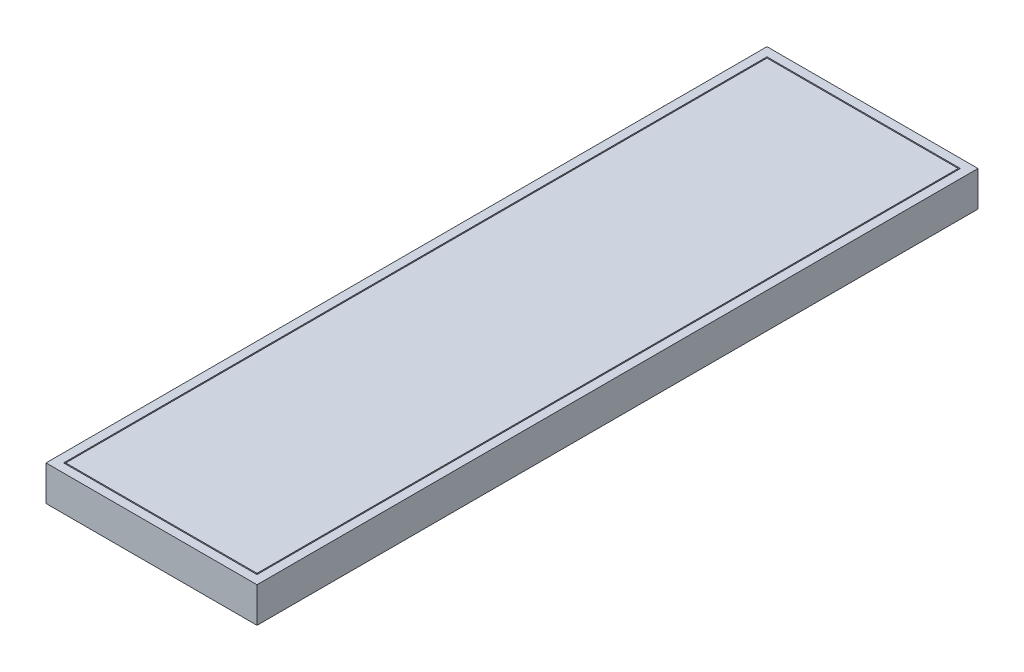
ISO-10303-21;
HEADER;
FILE_DESCRIPTION(('STEP AP214'),'2;1');
FILE_NAME('part.step','',(''),(''),'','','');
FILE_SCHEMA(('AUTOMOTIVE_DESIGN { 1 0 10303 214 1 1 1 1 }'));
ENDSEC;
DATA;
#1=APPLICATION_CONTEXT('core data for automotive mechanical design processes');
#2=APPLICATION_PROTOCOL_DEFINITION('international standard','automotive_design',2000,#1);
#3=PRODUCT_CONTEXT('',#1,'mechanical');
#4=PRODUCT('Part','Part','',(#3));
#5=PRODUCT_RELATED_PRODUCT_CATEGORY('part','',(#4));
#6=PRODUCT_DEFINITION_FORMATION('','',#4);
#7=PRODUCT_DEFINITION_CONTEXT('part definition',#1,'design');
#8=PRODUCT_DEFINITION('design','',#6,#7);
#9=PRODUCT_DEFINITION_SHAPE('','',#8);
#10=(LENGTH_UNIT() NAMED_UNIT(*) SI_UNIT(.MILLI.,.METRE.));
#11=(NAMED_UNIT(*) PLANE_ANGLE_UNIT() SI_UNIT($,.RADIAN.));
#12=(NAMED_UNIT(*) SI_UNIT($,.STERADIAN.) SOLID_ANGLE_UNIT());
#13=UNCERTAINTY_MEASURE_WITH_UNIT(LENGTH_MEASURE(1.E-05),#10,'distance_accuracy_value','');
#14=(GEOMETRIC_REPRESENTATION_CONTEXT(3) GLOBAL_UNCERTAINTY_ASSIGNED_CONTEXT((#13)) GLOBAL_UNIT_ASSIGNED_CONTEXT((#10,
#11,#12)) REPRESENTATION_CONTEXT('',''));
#15=CARTESIAN_POINT('',(0.,0.,0.));
#16=DIRECTION('',(0.,0.,1.));
#17=DIRECTION('',(1.,0.,0.));
#18=AXIS2_PLACEMENT_3D('',#15,#16,#17);
#19=CARTESIAN_POINT('',(0.,8.99999999999999,0.));
#20=DIRECTION('',(0.,1.,0.));
#21=DIRECTION('',(0.,0.,1.));
#22=AXIS2_PLACEMENT_3D('',#19,#20,#21);
#23=PLANE('',#22);
#24=DIRECTION('',(0.,0.,1.));
#25=VECTOR('',#24,1.);
#26=CARTESIAN_POINT('',(-220.,8.99999999999999,20.));
#27=LINE('',#26,#25);
#28=CARTESIAN_POINT('',(-220.,8.99999999999999,20.));
#29=VERTEX_POINT('',#28);
#30=CARTESIAN_POINT('',(-220.,8.99999999999999,1620.));
#31=VERTEX_POINT('',#30);
#32=EDGE_CURVE('E155',#29,#31,#27,.T.);
#33=ORIENTED_EDGE('',*,*,#32,.T.);
#34=DIRECTION('',(1.,0.,0.));
#35=VECTOR('',#34,1.);
#36=CARTESIAN_POINT('',(-220.,8.99999999999999,1620.));
#37=LINE('',#36,#35);
#38=CARTESIAN_POINT('',(220.,8.99999999999999,1620.));
#39=VERTEX_POINT('',#38);
#40=EDGE_CURVE('E158',#31,#39,#37,.T.);
#41=ORIENTED_EDGE('',*,*,#40,.T.);
#42=DIRECTION('',(0.,0.,-1.));
#43=VECTOR('',#42,1.);
#44=CARTESIAN_POINT('',(220.,8.99999999999999,1620.));
#45=LINE('',#44,#43);
#46=CARTESIAN_POINT('',(220.,8.99999999999999,20.));
#47=VERTEX_POINT('',#46);
#48=EDGE_CURVE('E162',#39,#47,#45,.T.);
#49=ORIENTED_EDGE('',*,*,#48,.T.);
#50=DIRECTION('',(-1.,0.,0.));
#51=VECTOR('',#50,1.);
#52=CARTESIAN_POINT('',(220.,8.99999999999999,20.));
#53=LINE('',#52,#51);
#54=EDGE_CURVE('E165',#47,#29,#53,.T.);
#55=ORIENTED_EDGE('',*,*,#54,.T.);
#56=EDGE_LOOP('',(#33,#41,#49,#55));
#57=FACE_BOUND('',#56,.T.);
#58=DIRECTION('',(0.,0.,-1.));
#59=VECTOR('',#58,1.);
#60=CARTESIAN_POINT('',(217.5,8.99999999999999,22.5));
#61=LINE('',#60,#59);
#62=CARTESIAN_POINT('',(217.5,8.99999999999999,1617.5));
#63=VERTEX_POINT('',#62);
#64=CARTESIAN_POINT('',(217.5,8.99999999999999,22.5));
#65=VERTEX_POINT('',#64);
#66=EDGE_CURVE('E372',#63,#65,#61,.T.);
#67=ORIENTED_EDGE('',*,*,#66,.F.);
#68=DIRECTION('',(1.,0.,0.));
#69=VECTOR('',#68,1.);
#70=CARTESIAN_POINT('',(217.5,8.99999999999999,1617.5));
#71=LINE('',#70,#69);
#72=CARTESIAN_POINT('',(-217.5,8.99999999999999,1617.5));
#73=VERTEX_POINT('',#72);
#74=EDGE_CURVE('E147',#73,#63,#71,.T.);
#75=ORIENTED_EDGE('',*,*,#74,.F.);
#76=DIRECTION('',(0.,0.,1.));
#77=VECTOR('',#76,1.);
#78=CARTESIAN_POINT('',(-217.5,8.99999999999999,1617.5));
#79=LINE('',#78,#77);
#80=CARTESIAN_POINT('',(-217.5,8.99999999999999,22.5));
#81=VERTEX_POINT('',#80);
#82=EDGE_CURVE('E143',#81,#73,#79,.T.);
#83=ORIENTED_EDGE('',*,*,#82,.F.);
#84=DIRECTION('',(-1.,0.,0.));
#85=VECTOR('',#84,1.);
#86=CARTESIAN_POINT('',(-217.5,8.99999999999999,22.5));
#87=LINE('',#86,#85);
#88=EDGE_CURVE('E369',#65,#81,#87,.T.);
#89=ORIENTED_EDGE('',*,*,#88,.F.);
#90=EDGE_LOOP('',(#67,#75,#83,#89));
#91=FACE_BOUND('',#90,.T.);
#92=ADVANCED_FACE('F34',(#57,#91),#23,.T.);
#93=CARTESIAN_POINT('',(-240.,20.,1640.));
#94=DIRECTION('',(-1.,0.,0.));
#95=DIRECTION('',(0.,0.,1.));
#96=AXIS2_PLACEMENT_3D('',#93,#94,#95);
#97=PLANE('',#96);
#98=DIRECTION('',(0.,0.,-1.));
#99=VECTOR('',#98,1.);
#100=CARTESIAN_POINT('',(-240.,-60.,1640.));
#101=LINE('',#100,#99);
#102=CARTESIAN_POINT('',(-240.,-60.,1640.));
#103=VERTEX_POINT('',#102);
#104=CARTESIAN_POINT('',(-240.,-60.,0.));
#105=VERTEX_POINT('',#104);
#106=EDGE_CURVE('E178',#103,#105,#101,.T.);
#107=ORIENTED_EDGE('',*,*,#106,.F.);
#108=DIRECTION('',(0.,-1.,0.));
#109=VECTOR('',#108,1.);
#110=CARTESIAN_POINT('',(-240.,20.,1640.));
#111=LINE('',#110,#109);
#112=CARTESIAN_POINT('',(-240.,20.,1640.));
#113=VERTEX_POINT('',#112);
#114=EDGE_CURVE('E11',#113,#103,#111,.T.);
#115=ORIENTED_EDGE('',*,*,#114,.F.);
#116=DIRECTION('',(0.,0.,-1.));
#117=VECTOR('',#116,1.);
#118=CARTESIAN_POINT('',(-240.,20.,1640.));
#119=LINE('',#118,#117);
#120=CARTESIAN_POINT('',(-240.,20.,0.));
#121=VERTEX_POINT('',#120);
#122=EDGE_CURVE('E184',#113,#121,#119,.T.);
#123=ORIENTED_EDGE('',*,*,#122,.T.);
#124=DIRECTION('',(0.,-1.,0.));
#125=VECTOR('',#124,1.);
#126=CARTESIAN_POINT('',(-240.,20.,0.));
#127=LINE('',#126,#125);
#128=EDGE_CURVE('E38',#121,#105,#127,.T.);
#129=ORIENTED_EDGE('',*,*,#128,.T.);
#130=EDGE_LOOP('',(#107,#115,#123,#129));
#131=FACE_BOUND('',#130,.T.);
#132=ADVANCED_FACE('F36',(#131),#97,.T.);
#133=CARTESIAN_POINT('',(240.,20.,1640.));
#134=DIRECTION('',(0.,0.,1.));
#135=DIRECTION('',(1.,0.,0.));
#136=AXIS2_PLACEMENT_3D('',#133,#134,#135);
#137=PLANE('',#136);
#138=DIRECTION('',(-1.,0.,0.));
#139=VECTOR('',#138,1.);
#140=CARTESIAN_POINT('',(240.,-60.,1640.));
#141=LINE('',#140,#139);
#142=CARTESIAN_POINT('',(240.,-60.,1640.));
#143=VERTEX_POINT('',#142);
#144=EDGE_CURVE('E188',#143,#103,#141,.T.);
#145=ORIENTED_EDGE('',*,*,#144,.F.);
#146=DIRECTION('',(0.,-1.,0.));
#147=VECTOR('',#146,1.);
#148=CARTESIAN_POINT('',(240.,20.,1640.));
#149=LINE('',#148,#147);
#150=CARTESIAN_POINT('',(240.,20.,1640.));
#151=VERTEX_POINT('',#150);
#152=EDGE_CURVE('E43',#151,#143,#149,.T.);
#153=ORIENTED_EDGE('',*,*,#152,.F.);
#154=DIRECTION('',(-1.,0.,0.));
#155=VECTOR('',#154,1.);
#156=CARTESIAN_POINT('',(240.,20.,1640.));
#157=LINE('',#156,#155);
#158=EDGE_CURVE('E194',#151,#113,#157,.T.);
#159=ORIENTED_EDGE('',*,*,#158,.T.);
#160=ORIENTED_EDGE('',*,*,#114,.T.);
#161=EDGE_LOOP('',(#145,#153,#159,#160));
#162=FACE_BOUND('',#161,.T.);
#163=ADVANCED_FACE('F220',(#162),#137,.T.);
#164=CARTESIAN_POINT('',(240.,20.,0.));
#165=DIRECTION('',(1.,0.,0.));
#166=DIRECTION('',(0.,0.,-1.));
#167=AXIS2_PLACEMENT_3D('',#164,#165,#166);
#168=PLANE('',#167);
#169=DIRECTION('',(0.,0.,1.));
#170=VECTOR('',#169,1.);
#171=CARTESIAN_POINT('',(240.,-60.,0.));
#172=LINE('',#171,#170);
#173=CARTESIAN_POINT('',(240.,-60.,0.));
#174=VERTEX_POINT('',#173);
#175=EDGE_CURVE('E202',#174,#143,#172,.T.);
#176=ORIENTED_EDGE('',*,*,#175,.F.);
#177=DIRECTION('',(0.,-1.,0.));
#178=VECTOR('',#177,1.);
#179=CARTESIAN_POINT('',(240.,20.,0.));
#180=LINE('',#179,#178);
#181=CARTESIAN_POINT('',(240.,20.,0.));
#182=VERTEX_POINT('',#181);
#183=EDGE_CURVE('E207',#182,#174,#180,.T.);
#184=ORIENTED_EDGE('',*,*,#183,.F.);
#185=DIRECTION('',(0.,0.,1.));
#186=VECTOR('',#185,1.);
#187=CARTESIAN_POINT('',(240.,20.,0.));
#188=LINE('',#187,#186);
#189=EDGE_CURVE('E191',#182,#151,#188,.T.);
#190=ORIENTED_EDGE('',*,*,#189,.T.);
#191=ORIENTED_EDGE('',*,*,#152,.T.);
#192=EDGE_LOOP('',(#176,#184,#190,#191));
#193=FACE_BOUND('',#192,.T.);
#194=ADVANCED_FACE('F226',(#193),#168,.T.);
#195=CARTESIAN_POINT('',(-240.,20.,0.));
#196=DIRECTION('',(0.,0.,-1.));
#197=DIRECTION('',(-1.,0.,0.));
#198=AXIS2_PLACEMENT_3D('',#195,#196,#197);
#199=PLANE('',#198);
#200=DIRECTION('',(1.,0.,0.));
#201=VECTOR('',#200,1.);
#202=CARTESIAN_POINT('',(-240.,-60.,0.));
#203=LINE('',#202,#201);
#204=EDGE_CURVE('E199',#105,#174,#203,.T.);
#205=ORIENTED_EDGE('',*,*,#204,.F.);
#206=ORIENTED_EDGE('',*,*,#128,.F.);
#207=DIRECTION('',(1.,0.,0.));
#208=VECTOR('',#207,1.);
#209=CARTESIAN_POINT('',(-240.,20.,0.));
#210=LINE('',#209,#208);
#211=EDGE_CURVE('E187',#121,#182,#210,.T.);
#212=ORIENTED_EDGE('',*,*,#211,.T.);
#213=ORIENTED_EDGE('',*,*,#183,.T.);
#214=EDGE_LOOP('',(#205,#206,#212,#213));
#215=FACE_BOUND('',#214,.T.);
#216=ADVANCED_FACE('F215',(#215),#199,.T.);
#217=CARTESIAN_POINT('',(0.,20.,0.));
#218=DIRECTION('',(0.,-1.,0.));
#219=DIRECTION('',(0.,0.,-1.));
#220=AXIS2_PLACEMENT_3D('',#217,#218,#219);
#221=PLANE('',#220);
#222=DIRECTION('',(1.,0.,0.));
#223=VECTOR('',#222,1.);
#224=CARTESIAN_POINT('',(-220.,20.,1620.));
#225=LINE('',#224,#223);
#226=CARTESIAN_POINT('',(-220.,20.,1620.));
#227=VERTEX_POINT('',#226);
#228=CARTESIAN_POINT('',(220.,20.,1620.));
#229=VERTEX_POINT('',#228);
#230=EDGE_CURVE('E150',#227,#229,#225,.T.);
#231=ORIENTED_EDGE('',*,*,#230,.F.);
#232=DIRECTION('',(0.,0.,1.));
#233=VECTOR('',#232,1.);
#234=CARTESIAN_POINT('',(-220.,20.,20.));
#235=LINE('',#234,#233);
#236=CARTESIAN_POINT('',(-220.,20.,20.));
#237=VERTEX_POINT('',#236);
#238=EDGE_CURVE('E59',#237,#227,#235,.T.);
#239=ORIENTED_EDGE('',*,*,#238,.F.);
#240=DIRECTION('',(-1.,0.,0.));
#241=VECTOR('',#240,1.);
#242=CARTESIAN_POINT('',(220.,20.,20.));
#243=LINE('',#242,#241);
#244=CARTESIAN_POINT('',(220.,20.,20.));
#245=VERTEX_POINT('',#244);
#246=EDGE_CURVE('E159',#245,#237,#243,.T.);
#247=ORIENTED_EDGE('',*,*,#246,.F.);
#248=DIRECTION('',(0.,0.,-1.));
#249=VECTOR('',#248,1.);
#250=CARTESIAN_POINT('',(220.,20.,1620.));
#251=LINE('',#250,#249);
#252=EDGE_CURVE('E171',#229,#245,#251,.T.);
#253=ORIENTED_EDGE('',*,*,#252,.F.);
#254=EDGE_LOOP('',(#231,#239,#247,#253));
#255=FACE_BOUND('',#254,.T.);
#256=ORIENTED_EDGE('',*,*,#122,.F.);
#257=ORIENTED_EDGE('',*,*,#158,.F.);
#258=ORIENTED_EDGE('',*,*,#189,.F.);
#259=ORIENTED_EDGE('',*,*,#211,.F.);
#260=EDGE_LOOP('',(#256,#257,#258,#259));
#261=FACE_BOUND('',#260,.T.);
#262=ADVANCED_FACE('F223',(#255,#261),#221,.F.);
#263=CARTESIAN_POINT('',(0.,-60.,0.));
#264=DIRECTION('',(0.,-1.,0.));
#265=DIRECTION('',(0.,0.,-1.));
#266=AXIS2_PLACEMENT_3D('',#263,#264,#265);
#267=PLANE('',#266);
#268=ORIENTED_EDGE('',*,*,#106,.T.);
#269=ORIENTED_EDGE('',*,*,#204,.T.);
#270=ORIENTED_EDGE('',*,*,#175,.T.);
#271=ORIENTED_EDGE('',*,*,#144,.T.);
#272=EDGE_LOOP('',(#268,#269,#270,#271));
#273=FACE_BOUND('',#272,.T.);
#274=ADVANCED_FACE('F217',(#273),#267,.T.);
#275=CARTESIAN_POINT('',(-220.,8.99999999999999,20.));
#276=DIRECTION('',(-1.,0.,0.));
#277=DIRECTION('',(0.,0.,1.));
#278=AXIS2_PLACEMENT_3D('',#275,#276,#277);
#279=PLANE('',#278);
#280=ORIENTED_EDGE('',*,*,#238,.T.);
#281=DIRECTION('',(0.,1.,0.));
#282=VECTOR('',#281,1.);
#283=CARTESIAN_POINT('',(-220.,8.99999999999999,1620.));
#284=LINE('',#283,#282);
#285=EDGE_CURVE('E167',#31,#227,#284,.T.);
#286=ORIENTED_EDGE('',*,*,#285,.F.);
#287=ORIENTED_EDGE('',*,*,#32,.F.);
#288=DIRECTION('',(0.,1.,0.));
#289=VECTOR('',#288,1.);
#290=CARTESIAN_POINT('',(-220.,8.99999999999999,20.));
#291=LINE('',#290,#289);
#292=EDGE_CURVE('E176',#29,#237,#291,.T.);
#293=ORIENTED_EDGE('',*,*,#292,.T.);
#294=EDGE_LOOP('',(#280,#286,#287,#293));
#295=FACE_BOUND('',#294,.T.);
#296=ADVANCED_FACE('F248',(#295),#279,.F.);
#297=CARTESIAN_POINT('',(220.,8.99999999999999,20.));
#298=DIRECTION('',(0.,0.,-1.));
#299=DIRECTION('',(-1.,0.,0.));
#300=AXIS2_PLACEMENT_3D('',#297,#298,#299);
#301=PLANE('',#300);
#302=ORIENTED_EDGE('',*,*,#246,.T.);
#303=ORIENTED_EDGE('',*,*,#292,.F.);
#304=ORIENTED_EDGE('',*,*,#54,.F.);
#305=DIRECTION('',(0.,1.,0.));
#306=VECTOR('',#305,1.);
#307=CARTESIAN_POINT('',(220.,8.99999999999999,20.));
#308=LINE('',#307,#306);
#309=EDGE_CURVE('E179',#47,#245,#308,.T.);
#310=ORIENTED_EDGE('',*,*,#309,.T.);
#311=EDGE_LOOP('',(#302,#303,#304,#310));
#312=FACE_BOUND('',#311,.T.);
#313=ADVANCED_FACE('F244',(#312),#301,.F.);
#314=CARTESIAN_POINT('',(220.,8.99999999999999,1620.));
#315=DIRECTION('',(1.,0.,0.));
#316=DIRECTION('',(0.,0.,-1.));
#317=AXIS2_PLACEMENT_3D('',#314,#315,#316);
#318=PLANE('',#317);
#319=ORIENTED_EDGE('',*,*,#252,.T.);
#320=ORIENTED_EDGE('',*,*,#309,.F.);
#321=ORIENTED_EDGE('',*,*,#48,.F.);
#322=DIRECTION('',(0.,1.,0.));
#323=VECTOR('',#322,1.);
#324=CARTESIAN_POINT('',(220.,8.99999999999999,1620.));
#325=LINE('',#324,#323);
#326=EDGE_CURVE('E181',#39,#229,#325,.T.);
#327=ORIENTED_EDGE('',*,*,#326,.T.);
#328=EDGE_LOOP('',(#319,#320,#321,#327));
#329=FACE_BOUND('',#328,.T.);
#330=ADVANCED_FACE('F247',(#329),#318,.F.);
#331=CARTESIAN_POINT('',(-220.,8.99999999999999,1620.));
#332=DIRECTION('',(0.,0.,1.));
#333=DIRECTION('',(1.,0.,0.));
#334=AXIS2_PLACEMENT_3D('',#331,#332,#333);
#335=PLANE('',#334);
#336=ORIENTED_EDGE('',*,*,#230,.T.);
#337=ORIENTED_EDGE('',*,*,#326,.F.);
#338=ORIENTED_EDGE('',*,*,#40,.F.);
#339=ORIENTED_EDGE('',*,*,#285,.T.);
#340=EDGE_LOOP('',(#336,#337,#338,#339));
#341=FACE_BOUND('',#340,.T.);
#342=ADVANCED_FACE('F252',(#341),#335,.F.);
#343=CARTESIAN_POINT('',(217.5,20.,1617.5));
#344=DIRECTION('',(0.,0.,-1.));
#345=DIRECTION('',(-1.,0.,0.));
#346=AXIS2_PLACEMENT_3D('',#343,#344,#345);
#347=PLANE('',#346);
#348=ORIENTED_EDGE('',*,*,#74,.T.);
#349=DIRECTION('',(0.,-1.,0.));
#350=VECTOR('',#349,1.);
#351=CARTESIAN_POINT('',(217.5,20.,1617.5));
#352=LINE('',#351,#350);
#353=CARTESIAN_POINT('',(217.5,20.,1617.5));
#354=VERTEX_POINT('',#353);
#355=EDGE_CURVE('E128',#354,#63,#352,.T.);
#356=ORIENTED_EDGE('',*,*,#355,.F.);
#357=DIRECTION('',(1.,0.,0.));
#358=VECTOR('',#357,1.);
#359=CARTESIAN_POINT('',(217.5,20.,1617.5));
#360=LINE('',#359,#358);
#361=CARTESIAN_POINT('',(-217.5,20.,1617.5));
#362=VERTEX_POINT('',#361);
#363=EDGE_CURVE('E135',#362,#354,#360,.T.);
#364=ORIENTED_EDGE('',*,*,#363,.F.);
#365=DIRECTION('',(0.,-1.,0.));
#366=VECTOR('',#365,1.);
#367=CARTESIAN_POINT('',(-217.5,20.,1617.5));
#368=LINE('',#367,#366);
#369=EDGE_CURVE('E367',#362,#73,#368,.T.);
#370=ORIENTED_EDGE('',*,*,#369,.T.);
#371=EDGE_LOOP('',(#348,#356,#364,#370));
#372=FACE_BOUND('',#371,.T.);
#373=ADVANCED_FACE('F145',(#372),#347,.F.);
#374=CARTESIAN_POINT('',(217.5,20.,22.5));
#375=DIRECTION('',(-1.,0.,0.));
#376=DIRECTION('',(0.,0.,1.));
#377=AXIS2_PLACEMENT_3D('',#374,#375,#376);
#378=PLANE('',#377);
#379=ORIENTED_EDGE('',*,*,#66,.T.);
#380=DIRECTION('',(0.,-1.,0.));
#381=VECTOR('',#380,1.);
#382=CARTESIAN_POINT('',(217.5,20.,22.5));
#383=LINE('',#382,#381);
#384=CARTESIAN_POINT('',(217.5,20.,22.5));
#385=VERTEX_POINT('',#384);
#386=EDGE_CURVE('E131',#385,#65,#383,.T.);
#387=ORIENTED_EDGE('',*,*,#386,.F.);
#388=DIRECTION('',(0.,0.,-1.));
#389=VECTOR('',#388,1.);
#390=CARTESIAN_POINT('',(217.5,20.,22.5));
#391=LINE('',#390,#389);
#392=EDGE_CURVE('E124',#354,#385,#391,.T.);
#393=ORIENTED_EDGE('',*,*,#392,.F.);
#394=ORIENTED_EDGE('',*,*,#355,.T.);
#395=EDGE_LOOP('',(#379,#387,#393,#394));
#396=FACE_BOUND('',#395,.T.);
#397=ADVANCED_FACE('F126',(#396),#378,.F.);
#398=CARTESIAN_POINT('',(-217.5,20.,22.5));
#399=DIRECTION('',(0.,0.,1.));
#400=DIRECTION('',(1.,0.,0.));
#401=AXIS2_PLACEMENT_3D('',#398,#399,#400);
#402=PLANE('',#401);
#403=ORIENTED_EDGE('',*,*,#88,.T.);
#404=DIRECTION('',(0.,-1.,0.));
#405=VECTOR('',#404,1.);
#406=CARTESIAN_POINT('',(-217.5,20.,22.5));
#407=LINE('',#406,#405);
#408=CARTESIAN_POINT('',(-217.5,20.,22.5));
#409=VERTEX_POINT('',#408);
#410=EDGE_CURVE('E51',#409,#81,#407,.T.);
#411=ORIENTED_EDGE('',*,*,#410,.F.);
#412=DIRECTION('',(-1.,0.,0.));
#413=VECTOR('',#412,1.);
#414=CARTESIAN_POINT('',(-217.5,20.,22.5));
#415=LINE('',#414,#413);
#416=EDGE_CURVE('E134',#385,#409,#415,.T.);
#417=ORIENTED_EDGE('',*,*,#416,.F.);
#418=ORIENTED_EDGE('',*,*,#386,.T.);
#419=EDGE_LOOP('',(#403,#411,#417,#418));
#420=FACE_BOUND('',#419,.T.);
#421=ADVANCED_FACE('F295',(#420),#402,.F.);
#422=CARTESIAN_POINT('',(-217.5,20.,1617.5));
#423=DIRECTION('',(1.,0.,0.));
#424=DIRECTION('',(0.,0.,-1.));
#425=AXIS2_PLACEMENT_3D('',#422,#423,#424);
#426=PLANE('',#425);
#427=ORIENTED_EDGE('',*,*,#82,.T.);
#428=ORIENTED_EDGE('',*,*,#369,.F.);
#429=DIRECTION('',(0.,0.,1.));
#430=VECTOR('',#429,1.);
#431=CARTESIAN_POINT('',(-217.5,20.,1617.5));
#432=LINE('',#431,#430);
#433=EDGE_CURVE('E139',#409,#362,#432,.T.);
#434=ORIENTED_EDGE('',*,*,#433,.F.);
#435=ORIENTED_EDGE('',*,*,#410,.T.);
#436=EDGE_LOOP('',(#427,#428,#434,#435));
#437=FACE_BOUND('',#436,.T.);
#438=ADVANCED_FACE('F301',(#437),#426,.F.);
#439=CARTESIAN_POINT('',(0.,20.,0.));
#440=DIRECTION('',(0.,-1.,0.));
#441=DIRECTION('',(0.,0.,-1.));
#442=AXIS2_PLACEMENT_3D('',#439,#440,#441);
#443=PLANE('',#442);
#444=ORIENTED_EDGE('',*,*,#363,.T.);
#445=ORIENTED_EDGE('',*,*,#392,.T.);
#446=ORIENTED_EDGE('',*,*,#416,.T.);
#447=ORIENTED_EDGE('',*,*,#433,.T.);
#448=EDGE_LOOP('',(#444,#445,#446,#447));
#449=FACE_BOUND('',#448,.T.);
#450=ADVANCED_FACE('F138',(#449),#443,.F.);
#451=CLOSED_SHELL('',(#92,#132,#163,#194,#216,#262,#274,#296,#313,#330,#342,#373,#397,#421,#438,#450));
#452=MANIFOLD_SOLID_BREP('B2',#451);
#453=ADVANCED_BREP_SHAPE_REPRESENTATION('',(#18,#452),#14);
#454=SHAPE_DEFINITION_REPRESENTATION(#9,#453);
ENDSEC;
END-ISO-10303-21;
